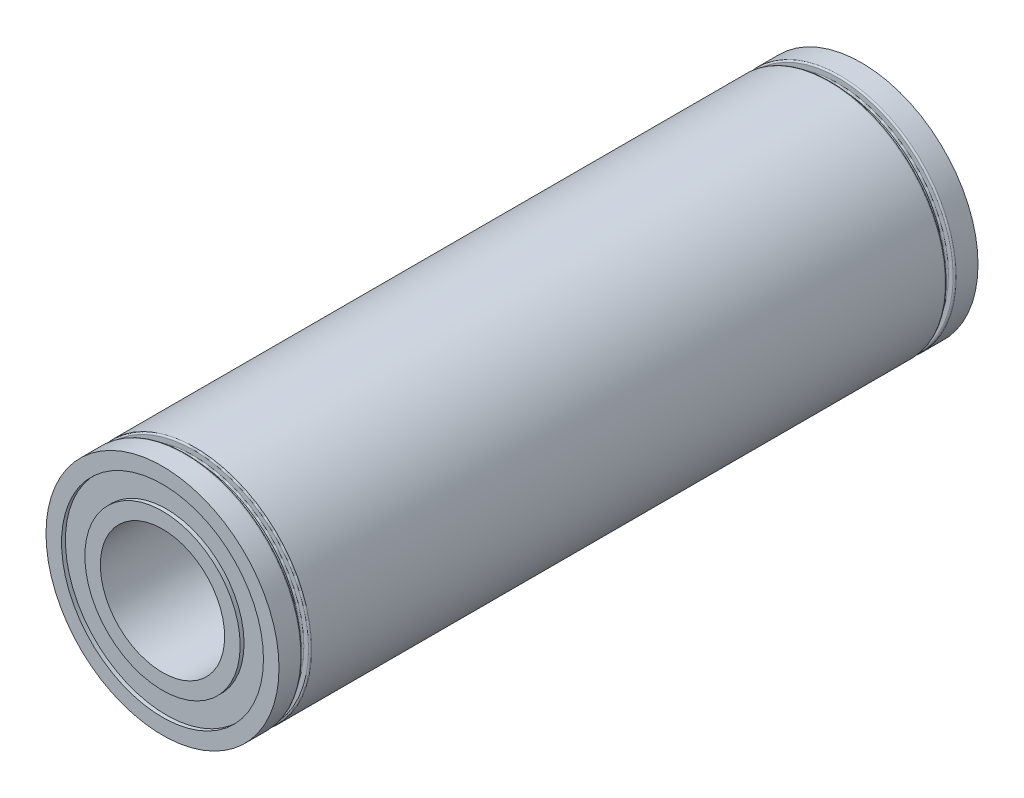
ISO-10303-21;
HEADER;
FILE_DESCRIPTION(('STEP AP214'),'2;1');
FILE_NAME('part.step','',(''),(''),'','','');
FILE_SCHEMA(('AUTOMOTIVE_DESIGN { 1 0 10303 214 1 1 1 1 }'));
ENDSEC;
DATA;
#1=APPLICATION_CONTEXT('core data for automotive mechanical design processes');
#2=APPLICATION_PROTOCOL_DEFINITION('international standard','automotive_design',2000,#1);
#3=PRODUCT_CONTEXT('',#1,'mechanical');
#4=PRODUCT('Part','Part','',(#3));
#5=PRODUCT_RELATED_PRODUCT_CATEGORY('part','',(#4));
#6=PRODUCT_DEFINITION_FORMATION('','',#4);
#7=PRODUCT_DEFINITION_CONTEXT('part definition',#1,'design');
#8=PRODUCT_DEFINITION('design','',#6,#7);
#9=PRODUCT_DEFINITION_SHAPE('','',#8);
#10=(LENGTH_UNIT() NAMED_UNIT(*) SI_UNIT(.MILLI.,.METRE.));
#11=(NAMED_UNIT(*) PLANE_ANGLE_UNIT() SI_UNIT($,.RADIAN.));
#12=(NAMED_UNIT(*) SI_UNIT($,.STERADIAN.) SOLID_ANGLE_UNIT());
#13=UNCERTAINTY_MEASURE_WITH_UNIT(LENGTH_MEASURE(1.E-05),#10,'distance_accuracy_value','');
#14=(GEOMETRIC_REPRESENTATION_CONTEXT(3) GLOBAL_UNCERTAINTY_ASSIGNED_CONTEXT((#13)) GLOBAL_UNIT_ASSIGNED_CONTEXT((#10,
#11,#12)) REPRESENTATION_CONTEXT('',''));
#15=CARTESIAN_POINT('',(0.,0.,0.));
#16=DIRECTION('',(0.,0.,1.));
#17=DIRECTION('',(1.,0.,0.));
#18=AXIS2_PLACEMENT_3D('',#15,#16,#17);
#19=CARTESIAN_POINT('',(0.,0.,22.5));
#20=DIRECTION('',(0.,0.,-1.));
#21=DIRECTION('',(-1.,0.,0.));
#22=AXIS2_PLACEMENT_3D('',#19,#20,#21);
#23=CYLINDRICAL_SURFACE('',#22,7.5);
#24=CARTESIAN_POINT('',(0.,0.,-21.1));
#25=DIRECTION('',(0.,0.,1.));
#26=DIRECTION('',(1.,0.,0.));
#27=AXIS2_PLACEMENT_3D('',#24,#25,#26);
#28=CIRCLE('',#27,7.5);
#29=CARTESIAN_POINT('',(7.5,0.,-21.1));
#30=VERTEX_POINT('',#29);
#31=EDGE_CURVE('E82',#30,#30,#28,.F.);
#32=ORIENTED_EDGE('',*,*,#31,.T.);
#33=EDGE_LOOP('',(#32));
#34=FACE_BOUND('',#33,.T.);
#35=CARTESIAN_POINT('',(0.,0.,-22.5));
#36=DIRECTION('',(0.,0.,1.));
#37=DIRECTION('',(1.,0.,0.));
#38=AXIS2_PLACEMENT_3D('',#35,#36,#37);
#39=CIRCLE('',#38,7.5);
#40=CARTESIAN_POINT('',(7.5,0.,-22.5));
#41=VERTEX_POINT('',#40);
#42=EDGE_CURVE('E122',#41,#41,#39,.T.);
#43=ORIENTED_EDGE('',*,*,#42,.T.);
#44=EDGE_LOOP('',(#43));
#45=FACE_BOUND('',#44,.T.);
#46=ADVANCED_FACE('F41',(#34,#45),#23,.T.);
#47=CARTESIAN_POINT('',(0.,0.,21.1));
#48=DIRECTION('',(0.,0.,-1.));
#49=DIRECTION('',(-1.,0.,0.));
#50=AXIS2_PLACEMENT_3D('',#47,#48,#49);
#51=CIRCLE('',#50,7.5);
#52=CARTESIAN_POINT('',(-7.5,0.,21.1));
#53=VERTEX_POINT('',#52);
#54=EDGE_CURVE('E11',#53,#53,#51,.F.);
#55=ORIENTED_EDGE('',*,*,#54,.T.);
#56=EDGE_LOOP('',(#55));
#57=FACE_BOUND('',#56,.T.);
#58=CARTESIAN_POINT('',(0.,0.,22.5));
#59=DIRECTION('',(0.,0.,1.));
#60=DIRECTION('',(1.,0.,0.));
#61=AXIS2_PLACEMENT_3D('',#58,#59,#60);
#62=CIRCLE('',#61,7.5);
#63=CARTESIAN_POINT('',(7.5,0.,22.5));
#64=VERTEX_POINT('',#63);
#65=EDGE_CURVE('E121',#64,#64,#62,.T.);
#66=ORIENTED_EDGE('',*,*,#65,.F.);
#67=EDGE_LOOP('',(#66));
#68=FACE_BOUND('',#67,.T.);
#69=ADVANCED_FACE('F143',(#57,#68),#23,.T.);
#70=CARTESIAN_POINT('',(0.,0.,22.5));
#71=DIRECTION('',(0.,0.,-1.));
#72=DIRECTION('',(-1.,0.,0.));
#73=AXIS2_PLACEMENT_3D('',#70,#71,#72);
#74=CYLINDRICAL_SURFACE('',#73,5.);
#75=CARTESIAN_POINT('',(0.,0.,-22.5));
#76=DIRECTION('',(0.,0.,1.));
#77=DIRECTION('',(1.,0.,0.));
#78=AXIS2_PLACEMENT_3D('',#75,#76,#77);
#79=CIRCLE('',#78,5.);
#80=CARTESIAN_POINT('',(5.,0.,-22.5));
#81=VERTEX_POINT('',#80);
#82=EDGE_CURVE('E101',#81,#81,#79,.T.);
#83=ORIENTED_EDGE('',*,*,#82,.T.);
#84=EDGE_LOOP('',(#83));
#85=FACE_BOUND('',#84,.T.);
#86=CARTESIAN_POINT('',(0.,0.,-22.25));
#87=DIRECTION('',(0.,0.,1.));
#88=DIRECTION('',(1.,0.,0.));
#89=AXIS2_PLACEMENT_3D('',#86,#87,#88);
#90=CIRCLE('',#89,5.);
#91=CARTESIAN_POINT('',(5.,0.,-22.25));
#92=VERTEX_POINT('',#91);
#93=EDGE_CURVE('E97',#92,#92,#90,.T.);
#94=ORIENTED_EDGE('',*,*,#93,.F.);
#95=EDGE_LOOP('',(#94));
#96=FACE_BOUND('',#95,.T.);
#97=ADVANCED_FACE('F145',(#85,#96),#74,.T.);
#98=CARTESIAN_POINT('',(0.,0.,22.5));
#99=DIRECTION('',(0.,0.,-1.));
#100=DIRECTION('',(-1.,0.,0.));
#101=AXIS2_PLACEMENT_3D('',#98,#99,#100);
#102=CYLINDRICAL_SURFACE('',#101,4.);
#103=CARTESIAN_POINT('',(0.,0.,22.5));
#104=DIRECTION('',(0.,0.,1.));
#105=DIRECTION('',(1.,0.,0.));
#106=AXIS2_PLACEMENT_3D('',#103,#104,#105);
#107=CIRCLE('',#106,4.);
#108=CARTESIAN_POINT('',(4.,0.,22.5));
#109=VERTEX_POINT('',#108);
#110=EDGE_CURVE('E104',#109,#109,#107,.T.);
#111=ORIENTED_EDGE('',*,*,#110,.T.);
#112=EDGE_LOOP('',(#111));
#113=FACE_BOUND('',#112,.T.);
#114=CARTESIAN_POINT('',(0.,0.,-22.5));
#115=DIRECTION('',(0.,0.,1.));
#116=DIRECTION('',(1.,0.,0.));
#117=AXIS2_PLACEMENT_3D('',#114,#115,#116);
#118=CIRCLE('',#117,4.);
#119=CARTESIAN_POINT('',(4.,0.,-22.5));
#120=VERTEX_POINT('',#119);
#121=EDGE_CURVE('E105',#120,#120,#118,.T.);
#122=ORIENTED_EDGE('',*,*,#121,.F.);
#123=EDGE_LOOP('',(#122));
#124=FACE_BOUND('',#123,.T.);
#125=ADVANCED_FACE('F152',(#113,#124),#102,.F.);
#126=CARTESIAN_POINT('',(0.,0.,22.25));
#127=DIRECTION('',(0.,0.,1.));
#128=DIRECTION('',(1.,0.,0.));
#129=AXIS2_PLACEMENT_3D('',#126,#127,#128);
#130=CIRCLE('',#129,5.);
#131=CARTESIAN_POINT('',(5.,0.,22.25));
#132=VERTEX_POINT('',#131);
#133=EDGE_CURVE('E108',#132,#132,#130,.T.);
#134=ORIENTED_EDGE('',*,*,#133,.T.);
#135=EDGE_LOOP('',(#134));
#136=FACE_BOUND('',#135,.T.);
#137=CARTESIAN_POINT('',(0.,0.,22.5));
#138=DIRECTION('',(0.,0.,1.));
#139=DIRECTION('',(1.,0.,0.));
#140=AXIS2_PLACEMENT_3D('',#137,#138,#139);
#141=CIRCLE('',#140,5.);
#142=CARTESIAN_POINT('',(5.,0.,22.5));
#143=VERTEX_POINT('',#142);
#144=EDGE_CURVE('E100',#143,#143,#141,.T.);
#145=ORIENTED_EDGE('',*,*,#144,.F.);
#146=EDGE_LOOP('',(#145));
#147=FACE_BOUND('',#146,.T.);
#148=ADVANCED_FACE('F155',(#136,#147),#74,.T.);
#149=CARTESIAN_POINT('',(0.,0.,22.5));
#150=DIRECTION('',(0.,0.,1.));
#151=DIRECTION('',(1.,0.,0.));
#152=AXIS2_PLACEMENT_3D('',#149,#150,#151);
#153=PLANE('',#152);
#154=ORIENTED_EDGE('',*,*,#110,.F.);
#155=EDGE_LOOP('',(#154));
#156=FACE_BOUND('',#155,.T.);
#157=ORIENTED_EDGE('',*,*,#144,.T.);
#158=EDGE_LOOP('',(#157));
#159=FACE_BOUND('',#158,.T.);
#160=ADVANCED_FACE('F376',(#156,#159),#153,.T.);
#161=CARTESIAN_POINT('',(0.,0.,-22.5));
#162=DIRECTION('',(0.,0.,1.));
#163=DIRECTION('',(1.,0.,0.));
#164=AXIS2_PLACEMENT_3D('',#161,#162,#163);
#165=PLANE('',#164);
#166=ORIENTED_EDGE('',*,*,#121,.T.);
#167=EDGE_LOOP('',(#166));
#168=FACE_BOUND('',#167,.T.);
#169=ORIENTED_EDGE('',*,*,#82,.F.);
#170=EDGE_LOOP('',(#169));
#171=FACE_BOUND('',#170,.T.);
#172=ADVANCED_FACE('F339',(#168,#171),#165,.F.);
#173=CARTESIAN_POINT('',(0.,0.,22.25));
#174=DIRECTION('',(0.,0.,1.));
#175=DIRECTION('',(1.,0.,0.));
#176=AXIS2_PLACEMENT_3D('',#173,#174,#175);
#177=PLANE('',#176);
#178=ORIENTED_EDGE('',*,*,#133,.F.);
#179=EDGE_LOOP('',(#178));
#180=FACE_BOUND('',#179,.T.);
#181=CARTESIAN_POINT('',(0.,0.,22.25));
#182=DIRECTION('',(0.,0.,1.));
#183=DIRECTION('',(1.,0.,0.));
#184=AXIS2_PLACEMENT_3D('',#181,#182,#183);
#185=CIRCLE('',#184,6.5);
#186=CARTESIAN_POINT('',(6.5,0.,22.25));
#187=VERTEX_POINT('',#186);
#188=EDGE_CURVE('E116',#187,#187,#185,.F.);
#189=ORIENTED_EDGE('',*,*,#188,.F.);
#190=EDGE_LOOP('',(#189));
#191=FACE_BOUND('',#190,.T.);
#192=ADVANCED_FACE('F329',(#180,#191),#177,.T.);
#193=CARTESIAN_POINT('',(0.,0.,-22.25));
#194=DIRECTION('',(0.,0.,1.));
#195=DIRECTION('',(1.,0.,0.));
#196=AXIS2_PLACEMENT_3D('',#193,#194,#195);
#197=PLANE('',#196);
#198=ORIENTED_EDGE('',*,*,#93,.T.);
#199=EDGE_LOOP('',(#198));
#200=FACE_BOUND('',#199,.T.);
#201=CARTESIAN_POINT('',(0.,0.,-22.25));
#202=DIRECTION('',(0.,0.,1.));
#203=DIRECTION('',(1.,0.,0.));
#204=AXIS2_PLACEMENT_3D('',#201,#202,#203);
#205=CIRCLE('',#204,6.5);
#206=CARTESIAN_POINT('',(6.5,0.,-22.25));
#207=VERTEX_POINT('',#206);
#208=EDGE_CURVE('E113',#207,#207,#205,.T.);
#209=ORIENTED_EDGE('',*,*,#208,.F.);
#210=EDGE_LOOP('',(#209));
#211=FACE_BOUND('',#210,.T.);
#212=ADVANCED_FACE('F322',(#200,#211),#197,.F.);
#213=CARTESIAN_POINT('',(0.,0.,22.5));
#214=DIRECTION('',(0.,0.,-1.));
#215=DIRECTION('',(-1.,0.,0.));
#216=AXIS2_PLACEMENT_3D('',#213,#214,#215);
#217=CYLINDRICAL_SURFACE('',#216,6.5);
#218=CARTESIAN_POINT('',(0.,0.,-22.5));
#219=DIRECTION('',(0.,0.,1.));
#220=DIRECTION('',(1.,0.,0.));
#221=AXIS2_PLACEMENT_3D('',#218,#219,#220);
#222=CIRCLE('',#221,6.5);
#223=CARTESIAN_POINT('',(6.5,0.,-22.5));
#224=VERTEX_POINT('',#223);
#225=EDGE_CURVE('E126',#224,#224,#222,.T.);
#226=ORIENTED_EDGE('',*,*,#225,.F.);
#227=EDGE_LOOP('',(#226));
#228=FACE_BOUND('',#227,.T.);
#229=ORIENTED_EDGE('',*,*,#208,.T.);
#230=EDGE_LOOP('',(#229));
#231=FACE_BOUND('',#230,.T.);
#232=ADVANCED_FACE('F328',(#228,#231),#217,.F.);
#233=ORIENTED_EDGE('',*,*,#188,.T.);
#234=EDGE_LOOP('',(#233));
#235=FACE_BOUND('',#234,.T.);
#236=CARTESIAN_POINT('',(0.,0.,22.5));
#237=DIRECTION('',(0.,0.,1.));
#238=DIRECTION('',(1.,0.,0.));
#239=AXIS2_PLACEMENT_3D('',#236,#237,#238);
#240=CIRCLE('',#239,6.5);
#241=CARTESIAN_POINT('',(6.5,0.,22.5));
#242=VERTEX_POINT('',#241);
#243=EDGE_CURVE('E125',#242,#242,#240,.T.);
#244=ORIENTED_EDGE('',*,*,#243,.T.);
#245=EDGE_LOOP('',(#244));
#246=FACE_BOUND('',#245,.T.);
#247=ADVANCED_FACE('F134',(#235,#246),#217,.F.);
#248=CARTESIAN_POINT('',(0.,0.,22.5));
#249=DIRECTION('',(0.,0.,1.));
#250=DIRECTION('',(1.,0.,0.));
#251=AXIS2_PLACEMENT_3D('',#248,#249,#250);
#252=PLANE('',#251);
#253=ORIENTED_EDGE('',*,*,#243,.F.);
#254=EDGE_LOOP('',(#253));
#255=FACE_BOUND('',#254,.T.);
#256=ORIENTED_EDGE('',*,*,#65,.T.);
#257=EDGE_LOOP('',(#256));
#258=FACE_BOUND('',#257,.T.);
#259=ADVANCED_FACE('F136',(#255,#258),#252,.T.);
#260=CARTESIAN_POINT('',(0.,0.,-22.5));
#261=DIRECTION('',(0.,0.,1.));
#262=DIRECTION('',(1.,0.,0.));
#263=AXIS2_PLACEMENT_3D('',#260,#261,#262);
#264=PLANE('',#263);
#265=ORIENTED_EDGE('',*,*,#225,.T.);
#266=EDGE_LOOP('',(#265));
#267=FACE_BOUND('',#266,.T.);
#268=ORIENTED_EDGE('',*,*,#42,.F.);
#269=EDGE_LOOP('',(#268));
#270=FACE_BOUND('',#269,.T.);
#271=ADVANCED_FACE('F139',(#267,#270),#264,.F.);
#272=CARTESIAN_POINT('',(7.,0.,20.5));
#273=DIRECTION('',(0.,0.,1.));
#274=DIRECTION('',(1.,0.,0.));
#275=AXIS2_PLACEMENT_3D('',#272,#273,#274);
#276=PLANE('',#275);
#277=CARTESIAN_POINT('',(0.,0.,20.5));
#278=DIRECTION('',(0.,0.,1.));
#279=DIRECTION('',(1.,0.,0.));
#280=AXIS2_PLACEMENT_3D('',#277,#278,#279);
#281=CIRCLE('',#280,7.1);
#282=CARTESIAN_POINT('',(7.1,0.,20.5));
#283=VERTEX_POINT('',#282);
#284=EDGE_CURVE('E48',#283,#283,#281,.F.);
#285=ORIENTED_EDGE('',*,*,#284,.T.);
#286=EDGE_LOOP('',(#285));
#287=FACE_BOUND('',#286,.T.);
#288=CARTESIAN_POINT('',(0.,0.,20.5));
#289=DIRECTION('',(0.,0.,1.));
#290=DIRECTION('',(1.,0.,0.));
#291=AXIS2_PLACEMENT_3D('',#288,#289,#290);
#292=CIRCLE('',#291,7.4);
#293=CARTESIAN_POINT('',(7.4,0.,20.5));
#294=VERTEX_POINT('',#293);
#295=EDGE_CURVE('E52',#294,#294,#292,.T.);
#296=ORIENTED_EDGE('',*,*,#295,.T.);
#297=EDGE_LOOP('',(#296));
#298=FACE_BOUND('',#297,.T.);
#299=ADVANCED_FACE('F183',(#287,#298),#276,.T.);
#300=CARTESIAN_POINT('',(7.,0.,21.));
#301=DIRECTION('',(0.,0.,-1.));
#302=DIRECTION('',(-1.,0.,0.));
#303=AXIS2_PLACEMENT_3D('',#300,#301,#302);
#304=PLANE('',#303);
#305=CARTESIAN_POINT('',(0.,0.,21.));
#306=DIRECTION('',(0.,0.,-1.));
#307=DIRECTION('',(-1.,0.,0.));
#308=AXIS2_PLACEMENT_3D('',#305,#306,#307);
#309=CIRCLE('',#308,7.1);
#310=CARTESIAN_POINT('',(-7.1,0.,21.));
#311=VERTEX_POINT('',#310);
#312=EDGE_CURVE('E56',#311,#311,#309,.F.);
#313=ORIENTED_EDGE('',*,*,#312,.T.);
#314=EDGE_LOOP('',(#313));
#315=FACE_BOUND('',#314,.T.);
#316=CARTESIAN_POINT('',(0.,0.,21.));
#317=DIRECTION('',(0.,0.,-1.));
#318=DIRECTION('',(-1.,0.,0.));
#319=AXIS2_PLACEMENT_3D('',#316,#317,#318);
#320=CIRCLE('',#319,7.4);
#321=CARTESIAN_POINT('',(-7.4,0.,21.));
#322=VERTEX_POINT('',#321);
#323=EDGE_CURVE('E61',#322,#322,#320,.T.);
#324=ORIENTED_EDGE('',*,*,#323,.T.);
#325=EDGE_LOOP('',(#324));
#326=FACE_BOUND('',#325,.T.);
#327=ADVANCED_FACE('F170',(#315,#326),#304,.T.);
#328=CARTESIAN_POINT('',(0.,0.,-22.5));
#329=DIRECTION('',(0.,0.,-1.));
#330=DIRECTION('',(-1.,0.,0.));
#331=AXIS2_PLACEMENT_3D('',#328,#329,#330);
#332=CYLINDRICAL_SURFACE('',#331,7.);
#333=CARTESIAN_POINT('',(0.,0.,20.9));
#334=DIRECTION('',(0.,0.,-1.));
#335=DIRECTION('',(-1.,0.,0.));
#336=AXIS2_PLACEMENT_3D('',#333,#334,#335);
#337=CIRCLE('',#336,7.);
#338=CARTESIAN_POINT('',(-7.,0.,20.9));
#339=VERTEX_POINT('',#338);
#340=EDGE_CURVE('E64',#339,#339,#337,.T.);
#341=ORIENTED_EDGE('',*,*,#340,.T.);
#342=EDGE_LOOP('',(#341));
#343=FACE_BOUND('',#342,.T.);
#344=CARTESIAN_POINT('',(0.,0.,20.6));
#345=DIRECTION('',(0.,0.,1.));
#346=DIRECTION('',(1.,0.,0.));
#347=AXIS2_PLACEMENT_3D('',#344,#345,#346);
#348=CIRCLE('',#347,7.);
#349=CARTESIAN_POINT('',(7.,0.,20.6));
#350=VERTEX_POINT('',#349);
#351=EDGE_CURVE('E67',#350,#350,#348,.T.);
#352=ORIENTED_EDGE('',*,*,#351,.T.);
#353=EDGE_LOOP('',(#352));
#354=FACE_BOUND('',#353,.T.);
#355=ADVANCED_FACE('F161',(#343,#354),#332,.T.);
#356=CARTESIAN_POINT('',(0.,0.,-20.4));
#357=DIRECTION('',(0.,0.,-1.));
#358=DIRECTION('',(-1.,0.,0.));
#359=AXIS2_PLACEMENT_3D('',#356,#357,#358);
#360=CIRCLE('',#359,7.5);
#361=CARTESIAN_POINT('',(-7.5,0.,-20.4));
#362=VERTEX_POINT('',#361);
#363=EDGE_CURVE('E70',#362,#362,#360,.F.);
#364=ORIENTED_EDGE('',*,*,#363,.T.);
#365=EDGE_LOOP('',(#364));
#366=FACE_BOUND('',#365,.T.);
#367=CARTESIAN_POINT('',(0.,0.,20.4));
#368=DIRECTION('',(0.,0.,1.));
#369=DIRECTION('',(1.,0.,0.));
#370=AXIS2_PLACEMENT_3D('',#367,#368,#369);
#371=CIRCLE('',#370,7.5);
#372=CARTESIAN_POINT('',(7.5,0.,20.4));
#373=VERTEX_POINT('',#372);
#374=EDGE_CURVE('E73',#373,#373,#371,.F.);
#375=ORIENTED_EDGE('',*,*,#374,.T.);
#376=EDGE_LOOP('',(#375));
#377=FACE_BOUND('',#376,.T.);
#378=ADVANCED_FACE('F147',(#366,#377),#23,.T.);
#379=CARTESIAN_POINT('',(7.,0.,-21.));
#380=DIRECTION('',(0.,0.,1.));
#381=DIRECTION('',(1.,0.,0.));
#382=AXIS2_PLACEMENT_3D('',#379,#380,#381);
#383=PLANE('',#382);
#384=CARTESIAN_POINT('',(0.,0.,-21.));
#385=DIRECTION('',(0.,0.,1.));
#386=DIRECTION('',(1.,0.,0.));
#387=AXIS2_PLACEMENT_3D('',#384,#385,#386);
#388=CIRCLE('',#387,7.1);
#389=CARTESIAN_POINT('',(7.1,0.,-21.));
#390=VERTEX_POINT('',#389);
#391=EDGE_CURVE('E91',#390,#390,#388,.F.);
#392=ORIENTED_EDGE('',*,*,#391,.T.);
#393=EDGE_LOOP('',(#392));
#394=FACE_BOUND('',#393,.T.);
#395=CARTESIAN_POINT('',(0.,0.,-21.));
#396=DIRECTION('',(0.,0.,1.));
#397=DIRECTION('',(1.,0.,0.));
#398=AXIS2_PLACEMENT_3D('',#395,#396,#397);
#399=CIRCLE('',#398,7.4);
#400=CARTESIAN_POINT('',(7.4,0.,-21.));
#401=VERTEX_POINT('',#400);
#402=EDGE_CURVE('E94',#401,#401,#399,.T.);
#403=ORIENTED_EDGE('',*,*,#402,.T.);
#404=EDGE_LOOP('',(#403));
#405=FACE_BOUND('',#404,.T.);
#406=ADVANCED_FACE('F160',(#394,#405),#383,.T.);
#407=CARTESIAN_POINT('',(7.,0.,-20.5));
#408=DIRECTION('',(0.,0.,-1.));
#409=DIRECTION('',(-1.,0.,0.));
#410=AXIS2_PLACEMENT_3D('',#407,#408,#409);
#411=PLANE('',#410);
#412=CARTESIAN_POINT('',(0.,0.,-20.5));
#413=DIRECTION('',(0.,0.,-1.));
#414=DIRECTION('',(-1.,0.,0.));
#415=AXIS2_PLACEMENT_3D('',#412,#413,#414);
#416=CIRCLE('',#415,7.1);
#417=CARTESIAN_POINT('',(-7.1,0.,-20.5));
#418=VERTEX_POINT('',#417);
#419=EDGE_CURVE('E76',#418,#418,#416,.F.);
#420=ORIENTED_EDGE('',*,*,#419,.T.);
#421=EDGE_LOOP('',(#420));
#422=FACE_BOUND('',#421,.T.);
#423=CARTESIAN_POINT('',(0.,0.,-20.5));
#424=DIRECTION('',(0.,0.,-1.));
#425=DIRECTION('',(-1.,0.,0.));
#426=AXIS2_PLACEMENT_3D('',#423,#424,#425);
#427=CIRCLE('',#426,7.4);
#428=CARTESIAN_POINT('',(-7.4,0.,-20.5));
#429=VERTEX_POINT('',#428);
#430=EDGE_CURVE('E79',#429,#429,#427,.T.);
#431=ORIENTED_EDGE('',*,*,#430,.T.);
#432=EDGE_LOOP('',(#431));
#433=FACE_BOUND('',#432,.T.);
#434=ADVANCED_FACE('F167',(#422,#433),#411,.T.);
#435=CARTESIAN_POINT('',(0.,0.,-22.5));
#436=DIRECTION('',(0.,0.,-1.));
#437=DIRECTION('',(-1.,0.,0.));
#438=AXIS2_PLACEMENT_3D('',#435,#436,#437);
#439=CYLINDRICAL_SURFACE('',#438,7.);
#440=CARTESIAN_POINT('',(0.,0.,-20.9));
#441=DIRECTION('',(0.,0.,1.));
#442=DIRECTION('',(1.,0.,0.));
#443=AXIS2_PLACEMENT_3D('',#440,#441,#442);
#444=CIRCLE('',#443,7.);
#445=CARTESIAN_POINT('',(7.,0.,-20.9));
#446=VERTEX_POINT('',#445);
#447=EDGE_CURVE('E85',#446,#446,#444,.T.);
#448=ORIENTED_EDGE('',*,*,#447,.T.);
#449=EDGE_LOOP('',(#448));
#450=FACE_BOUND('',#449,.T.);
#451=CARTESIAN_POINT('',(0.,0.,-20.6));
#452=DIRECTION('',(0.,0.,-1.));
#453=DIRECTION('',(-1.,0.,0.));
#454=AXIS2_PLACEMENT_3D('',#451,#452,#453);
#455=CIRCLE('',#454,7.);
#456=CARTESIAN_POINT('',(-7.,0.,-20.6));
#457=VERTEX_POINT('',#456);
#458=EDGE_CURVE('E88',#457,#457,#455,.T.);
#459=ORIENTED_EDGE('',*,*,#458,.T.);
#460=EDGE_LOOP('',(#459));
#461=FACE_BOUND('',#460,.T.);
#462=ADVANCED_FACE('F194',(#450,#461),#439,.T.);
#463=CARTESIAN_POINT('',(0.,0.,-20.9));
#464=DIRECTION('',(0.,0.,1.));
#465=DIRECTION('',(1.,0.,0.));
#466=AXIS2_PLACEMENT_3D('',#463,#464,#465);
#467=TOROIDAL_SURFACE('',#466,7.1,0.1);
#468=ORIENTED_EDGE('',*,*,#447,.F.);
#469=EDGE_LOOP('',(#468));
#470=FACE_BOUND('',#469,.T.);
#471=ORIENTED_EDGE('',*,*,#391,.F.);
#472=EDGE_LOOP('',(#471));
#473=FACE_BOUND('',#472,.T.);
#474=ADVANCED_FACE('F197',(#470,#473),#467,.F.);
#475=CARTESIAN_POINT('',(0.,0.,-21.1));
#476=DIRECTION('',(0.,0.,1.));
#477=DIRECTION('',(1.,0.,0.));
#478=AXIS2_PLACEMENT_3D('',#475,#476,#477);
#479=TOROIDAL_SURFACE('',#478,7.4,0.1);
#480=ORIENTED_EDGE('',*,*,#31,.F.);
#481=EDGE_LOOP('',(#480));
#482=FACE_BOUND('',#481,.T.);
#483=ORIENTED_EDGE('',*,*,#402,.F.);
#484=EDGE_LOOP('',(#483));
#485=FACE_BOUND('',#484,.T.);
#486=ADVANCED_FACE('F219',(#482,#485),#479,.T.);
#487=CARTESIAN_POINT('',(0.,0.,-20.6));
#488=DIRECTION('',(0.,0.,-1.));
#489=DIRECTION('',(-1.,0.,0.));
#490=AXIS2_PLACEMENT_3D('',#487,#488,#489);
#491=TOROIDAL_SURFACE('',#490,7.1,0.1);
#492=ORIENTED_EDGE('',*,*,#419,.F.);
#493=EDGE_LOOP('',(#492));
#494=FACE_BOUND('',#493,.T.);
#495=ORIENTED_EDGE('',*,*,#458,.F.);
#496=EDGE_LOOP('',(#495));
#497=FACE_BOUND('',#496,.T.);
#498=ADVANCED_FACE('F210',(#494,#497),#491,.F.);
#499=CARTESIAN_POINT('',(0.,0.,-20.4));
#500=DIRECTION('',(0.,0.,-1.));
#501=DIRECTION('',(-1.,0.,0.));
#502=AXIS2_PLACEMENT_3D('',#499,#500,#501);
#503=TOROIDAL_SURFACE('',#502,7.4,0.1);
#504=ORIENTED_EDGE('',*,*,#363,.F.);
#505=EDGE_LOOP('',(#504));
#506=FACE_BOUND('',#505,.T.);
#507=ORIENTED_EDGE('',*,*,#430,.F.);
#508=EDGE_LOOP('',(#507));
#509=FACE_BOUND('',#508,.T.);
#510=ADVANCED_FACE('F207',(#506,#509),#503,.T.);
#511=CARTESIAN_POINT('',(0.,0.,20.9));
#512=DIRECTION('',(0.,0.,-1.));
#513=DIRECTION('',(-1.,0.,0.));
#514=AXIS2_PLACEMENT_3D('',#511,#512,#513);
#515=TOROIDAL_SURFACE('',#514,7.1,0.1);
#516=ORIENTED_EDGE('',*,*,#312,.F.);
#517=EDGE_LOOP('',(#516));
#518=FACE_BOUND('',#517,.T.);
#519=ORIENTED_EDGE('',*,*,#340,.F.);
#520=EDGE_LOOP('',(#519));
#521=FACE_BOUND('',#520,.T.);
#522=ADVANCED_FACE('F209',(#518,#521),#515,.F.);
#523=CARTESIAN_POINT('',(0.,0.,20.6));
#524=DIRECTION('',(0.,0.,1.));
#525=DIRECTION('',(1.,0.,0.));
#526=AXIS2_PLACEMENT_3D('',#523,#524,#525);
#527=TOROIDAL_SURFACE('',#526,7.1,0.1);
#528=ORIENTED_EDGE('',*,*,#351,.F.);
#529=EDGE_LOOP('',(#528));
#530=FACE_BOUND('',#529,.T.);
#531=ORIENTED_EDGE('',*,*,#284,.F.);
#532=EDGE_LOOP('',(#531));
#533=FACE_BOUND('',#532,.T.);
#534=ADVANCED_FACE('F180',(#530,#533),#527,.F.);
#535=CARTESIAN_POINT('',(0.,0.,20.4));
#536=DIRECTION('',(0.,0.,1.));
#537=DIRECTION('',(1.,0.,0.));
#538=AXIS2_PLACEMENT_3D('',#535,#536,#537);
#539=TOROIDAL_SURFACE('',#538,7.4,0.1);
#540=ORIENTED_EDGE('',*,*,#374,.F.);
#541=EDGE_LOOP('',(#540));
#542=FACE_BOUND('',#541,.T.);
#543=ORIENTED_EDGE('',*,*,#295,.F.);
#544=EDGE_LOOP('',(#543));
#545=FACE_BOUND('',#544,.T.);
#546=ADVANCED_FACE('F177',(#542,#545),#539,.T.);
#547=CARTESIAN_POINT('',(0.,0.,21.1));
#548=DIRECTION('',(0.,0.,-1.));
#549=DIRECTION('',(-1.,0.,0.));
#550=AXIS2_PLACEMENT_3D('',#547,#548,#549);
#551=TOROIDAL_SURFACE('',#550,7.4,0.1);
#552=ORIENTED_EDGE('',*,*,#54,.F.);
#553=EDGE_LOOP('',(#552));
#554=FACE_BOUND('',#553,.T.);
#555=ORIENTED_EDGE('',*,*,#323,.F.);
#556=EDGE_LOOP('',(#555));
#557=FACE_BOUND('',#556,.T.);
#558=ADVANCED_FACE('F43',(#554,#557),#551,.T.);
#559=CLOSED_SHELL('',(#46,#69,#97,#125,#148,#160,#172,#192,#212,#232,#247,#259,#271,#299,#327,
#355,#378,#406,#434,#462,#474,#486,#498,#510,#522,#534,#546,#558));
#560=MANIFOLD_SOLID_BREP('B2',#559);
#561=ADVANCED_BREP_SHAPE_REPRESENTATION('',(#18,#560),#14);
#562=SHAPE_DEFINITION_REPRESENTATION(#9,#561);
ENDSEC;
END-ISO-10303-21;
